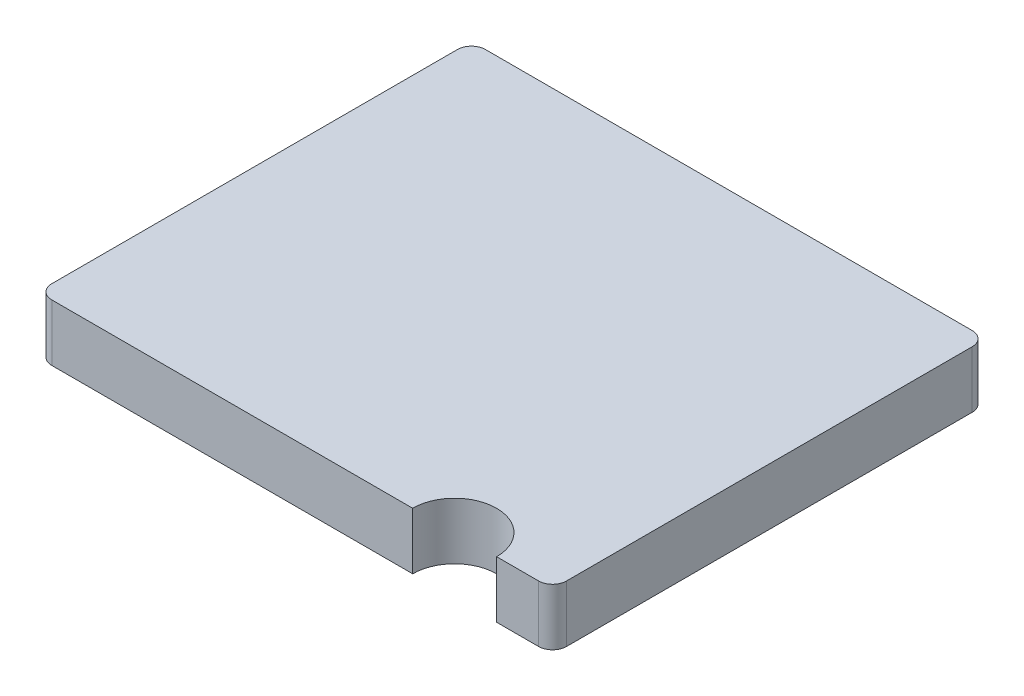
ISO-10303-21;
HEADER;
FILE_DESCRIPTION(('STEP AP214'),'2;1');
FILE_NAME('part.step','',(''),(''),'','','');
FILE_SCHEMA(('AUTOMOTIVE_DESIGN { 1 0 10303 214 1 1 1 1 }'));
ENDSEC;
DATA;
#1=APPLICATION_CONTEXT('core data for automotive mechanical design processes');
#2=APPLICATION_PROTOCOL_DEFINITION('international standard','automotive_design',2000,#1);
#3=PRODUCT_CONTEXT('',#1,'mechanical');
#4=PRODUCT('Part','Part','',(#3));
#5=PRODUCT_RELATED_PRODUCT_CATEGORY('part','',(#4));
#6=PRODUCT_DEFINITION_FORMATION('','',#4);
#7=PRODUCT_DEFINITION_CONTEXT('part definition',#1,'design');
#8=PRODUCT_DEFINITION('design','',#6,#7);
#9=PRODUCT_DEFINITION_SHAPE('','',#8);
#10=(LENGTH_UNIT() NAMED_UNIT(*) SI_UNIT(.MILLI.,.METRE.));
#11=(NAMED_UNIT(*) PLANE_ANGLE_UNIT() SI_UNIT($,.RADIAN.));
#12=(NAMED_UNIT(*) SI_UNIT($,.STERADIAN.) SOLID_ANGLE_UNIT());
#13=UNCERTAINTY_MEASURE_WITH_UNIT(LENGTH_MEASURE(1.E-05),#10,'distance_accuracy_value','');
#14=(GEOMETRIC_REPRESENTATION_CONTEXT(3) GLOBAL_UNCERTAINTY_ASSIGNED_CONTEXT((#13)) GLOBAL_UNIT_ASSIGNED_CONTEXT((#10,
#11,#12)) REPRESENTATION_CONTEXT('',''));
#15=CARTESIAN_POINT('',(0.,0.,0.));
#16=DIRECTION('',(0.,0.,1.));
#17=DIRECTION('',(1.,0.,0.));
#18=AXIS2_PLACEMENT_3D('',#15,#16,#17);
#19=CARTESIAN_POINT('',(-0.919999999999999,0.203,0.775));
#20=DIRECTION('',(0.,0.,-1.));
#21=DIRECTION('',(-1.,0.,0.));
#22=AXIS2_PLACEMENT_3D('',#19,#20,#21);
#23=PLANE('',#22);
#24=DIRECTION('',(1.,0.,0.));
#25=VECTOR('',#24,1.);
#26=CARTESIAN_POINT('',(-0.919999999999999,0.,0.775));
#27=LINE('',#26,#25);
#28=CARTESIAN_POINT('',(-0.869999999999999,0.,0.775));
#29=VERTEX_POINT('',#28);
#30=CARTESIAN_POINT('',(0.420000000000001,0.,0.775));
#31=VERTEX_POINT('',#30);
#32=EDGE_CURVE('E129',#29,#31,#27,.T.);
#33=ORIENTED_EDGE('',*,*,#32,.T.);
#34=DIRECTION('',(0.,1.,0.));
#35=VECTOR('',#34,1.);
#36=CARTESIAN_POINT('',(0.420000000000001,0.,0.775));
#37=LINE('',#36,#35);
#38=CARTESIAN_POINT('',(0.420000000000001,0.203,0.775));
#39=VERTEX_POINT('',#38);
#40=EDGE_CURVE('E51',#31,#39,#37,.T.);
#41=ORIENTED_EDGE('',*,*,#40,.T.);
#42=DIRECTION('',(1.,0.,0.));
#43=VECTOR('',#42,1.);
#44=CARTESIAN_POINT('',(-0.919999999999999,0.203,0.775));
#45=LINE('',#44,#43);
#46=CARTESIAN_POINT('',(-0.869999999999999,0.203,0.775));
#47=VERTEX_POINT('',#46);
#48=EDGE_CURVE('E141',#47,#39,#45,.T.);
#49=ORIENTED_EDGE('',*,*,#48,.F.);
#50=DIRECTION('',(0.,-1.,0.));
#51=VECTOR('',#50,1.);
#52=CARTESIAN_POINT('',(-0.869999999999999,0.203,0.775));
#53=LINE('',#52,#51);
#54=EDGE_CURVE('E44',#47,#29,#53,.T.);
#55=ORIENTED_EDGE('',*,*,#54,.T.);
#56=EDGE_LOOP('',(#33,#41,#49,#55));
#57=FACE_BOUND('',#56,.T.);
#58=ADVANCED_FACE('F36',(#57),#23,.F.);
#59=CARTESIAN_POINT('',(0.92,0.203,-0.775));
#60=DIRECTION('',(-1.,0.,0.));
#61=DIRECTION('',(0.,0.,1.));
#62=AXIS2_PLACEMENT_3D('',#59,#60,#61);
#63=PLANE('',#62);
#64=DIRECTION('',(0.,0.,-1.));
#65=VECTOR('',#64,1.);
#66=CARTESIAN_POINT('',(0.92,0.,-0.775));
#67=LINE('',#66,#65);
#68=CARTESIAN_POINT('',(0.920000000000001,0.,0.725));
#69=VERTEX_POINT('',#68);
#70=CARTESIAN_POINT('',(0.92,0.,-0.725));
#71=VERTEX_POINT('',#70);
#72=EDGE_CURVE('E192',#69,#71,#67,.T.);
#73=ORIENTED_EDGE('',*,*,#72,.T.);
#74=DIRECTION('',(0.,-1.,0.));
#75=VECTOR('',#74,1.);
#76=CARTESIAN_POINT('',(0.92,0.203,-0.725));
#77=LINE('',#76,#75);
#78=CARTESIAN_POINT('',(0.92,0.203,-0.725));
#79=VERTEX_POINT('',#78);
#80=EDGE_CURVE('E167',#71,#79,#77,.F.);
#81=ORIENTED_EDGE('',*,*,#80,.T.);
#82=DIRECTION('',(0.,0.,-1.));
#83=VECTOR('',#82,1.);
#84=CARTESIAN_POINT('',(0.92,0.203,-0.775));
#85=LINE('',#84,#83);
#86=CARTESIAN_POINT('',(0.920000000000001,0.203,0.725));
#87=VERTEX_POINT('',#86);
#88=EDGE_CURVE('E132',#87,#79,#85,.T.);
#89=ORIENTED_EDGE('',*,*,#88,.F.);
#90=DIRECTION('',(0.,-1.,0.));
#91=VECTOR('',#90,1.);
#92=CARTESIAN_POINT('',(0.920000000000001,0.203,0.725));
#93=LINE('',#92,#91);
#94=EDGE_CURVE('E164',#87,#69,#93,.T.);
#95=ORIENTED_EDGE('',*,*,#94,.T.);
#96=EDGE_LOOP('',(#73,#81,#89,#95));
#97=FACE_BOUND('',#96,.T.);
#98=ADVANCED_FACE('F216',(#97),#63,.F.);
#99=CARTESIAN_POINT('',(-0.92,0.203,-0.775));
#100=DIRECTION('',(0.,0.,1.));
#101=DIRECTION('',(1.,0.,0.));
#102=AXIS2_PLACEMENT_3D('',#99,#100,#101);
#103=PLANE('',#102);
#104=DIRECTION('',(-1.,0.,0.));
#105=VECTOR('',#104,1.);
#106=CARTESIAN_POINT('',(-0.92,0.,-0.775));
#107=LINE('',#106,#105);
#108=CARTESIAN_POINT('',(0.87,0.,-0.775));
#109=VERTEX_POINT('',#108);
#110=CARTESIAN_POINT('',(-0.87,0.,-0.775));
#111=VERTEX_POINT('',#110);
#112=EDGE_CURVE('E134',#109,#111,#107,.T.);
#113=ORIENTED_EDGE('',*,*,#112,.T.);
#114=DIRECTION('',(0.,-1.,0.));
#115=VECTOR('',#114,1.);
#116=CARTESIAN_POINT('',(-0.87,0.203,-0.775));
#117=LINE('',#116,#115);
#118=CARTESIAN_POINT('',(-0.87,0.203,-0.775));
#119=VERTEX_POINT('',#118);
#120=EDGE_CURVE('E154',#111,#119,#117,.F.);
#121=ORIENTED_EDGE('',*,*,#120,.T.);
#122=DIRECTION('',(-1.,0.,0.));
#123=VECTOR('',#122,1.);
#124=CARTESIAN_POINT('',(-0.92,0.203,-0.775));
#125=LINE('',#124,#123);
#126=CARTESIAN_POINT('',(0.87,0.203,-0.775));
#127=VERTEX_POINT('',#126);
#128=EDGE_CURVE('E186',#127,#119,#125,.T.);
#129=ORIENTED_EDGE('',*,*,#128,.F.);
#130=DIRECTION('',(0.,-1.,0.));
#131=VECTOR('',#130,1.);
#132=CARTESIAN_POINT('',(0.87,0.203,-0.775));
#133=LINE('',#132,#131);
#134=EDGE_CURVE('E151',#127,#109,#133,.T.);
#135=ORIENTED_EDGE('',*,*,#134,.T.);
#136=EDGE_LOOP('',(#113,#121,#129,#135));
#137=FACE_BOUND('',#136,.T.);
#138=ADVANCED_FACE('F198',(#137),#103,.F.);
#139=CARTESIAN_POINT('',(-0.92,0.203,-0.775));
#140=DIRECTION('',(1.,0.,0.));
#141=DIRECTION('',(0.,0.,-1.));
#142=AXIS2_PLACEMENT_3D('',#139,#140,#141);
#143=PLANE('',#142);
#144=DIRECTION('',(0.,0.,1.));
#145=VECTOR('',#144,1.);
#146=CARTESIAN_POINT('',(-0.92,0.203,-0.775));
#147=LINE('',#146,#145);
#148=CARTESIAN_POINT('',(-0.92,0.203,-0.725));
#149=VERTEX_POINT('',#148);
#150=CARTESIAN_POINT('',(-0.919999999999999,0.203,0.725));
#151=VERTEX_POINT('',#150);
#152=EDGE_CURVE('E183',#149,#151,#147,.T.);
#153=ORIENTED_EDGE('',*,*,#152,.F.);
#154=DIRECTION('',(0.,-1.,0.));
#155=VECTOR('',#154,1.);
#156=CARTESIAN_POINT('',(-0.92,0.203,-0.725));
#157=LINE('',#156,#155);
#158=CARTESIAN_POINT('',(-0.92,0.,-0.725));
#159=VERTEX_POINT('',#158);
#160=EDGE_CURVE('E140',#149,#159,#157,.T.);
#161=ORIENTED_EDGE('',*,*,#160,.T.);
#162=DIRECTION('',(0.,0.,1.));
#163=VECTOR('',#162,1.);
#164=CARTESIAN_POINT('',(-0.92,0.,-0.775));
#165=LINE('',#164,#163);
#166=CARTESIAN_POINT('',(-0.919999999999999,0.,0.725));
#167=VERTEX_POINT('',#166);
#168=EDGE_CURVE('E130',#159,#167,#165,.T.);
#169=ORIENTED_EDGE('',*,*,#168,.T.);
#170=DIRECTION('',(0.,-1.,0.));
#171=VECTOR('',#170,1.);
#172=CARTESIAN_POINT('',(-0.919999999999999,0.203,0.725));
#173=LINE('',#172,#171);
#174=EDGE_CURVE('E138',#167,#151,#173,.F.);
#175=ORIENTED_EDGE('',*,*,#174,.T.);
#176=EDGE_LOOP('',(#153,#161,#169,#175));
#177=FACE_BOUND('',#176,.T.);
#178=ADVANCED_FACE('F179',(#177),#143,.F.);
#179=CARTESIAN_POINT('',(0.720000000000001,0.203,0.775));
#180=VERTEX_POINT('',#179);
#181=CARTESIAN_POINT('',(0.87,0.203,0.775));
#182=VERTEX_POINT('',#181);
#183=EDGE_CURVE('E59',#180,#182,#45,.T.);
#184=ORIENTED_EDGE('',*,*,#183,.F.);
#185=DIRECTION('',(0.,1.,0.));
#186=VECTOR('',#185,1.);
#187=CARTESIAN_POINT('',(0.720000000000001,0.,0.775));
#188=LINE('',#187,#186);
#189=CARTESIAN_POINT('',(0.720000000000001,0.,0.775));
#190=VERTEX_POINT('',#189);
#191=EDGE_CURVE('E113',#180,#190,#188,.F.);
#192=ORIENTED_EDGE('',*,*,#191,.T.);
#193=CARTESIAN_POINT('',(0.87,0.,0.775));
#194=VERTEX_POINT('',#193);
#195=EDGE_CURVE('E122',#190,#194,#27,.T.);
#196=ORIENTED_EDGE('',*,*,#195,.T.);
#197=DIRECTION('',(0.,-1.,0.));
#198=VECTOR('',#197,1.);
#199=CARTESIAN_POINT('',(0.87,0.203,0.775));
#200=LINE('',#199,#198);
#201=EDGE_CURVE('E11',#194,#182,#200,.F.);
#202=ORIENTED_EDGE('',*,*,#201,.T.);
#203=EDGE_LOOP('',(#184,#192,#196,#202));
#204=FACE_BOUND('',#203,.T.);
#205=ADVANCED_FACE('F121',(#204),#23,.F.);
#206=CARTESIAN_POINT('',(0.,0.203,0.));
#207=DIRECTION('',(0.,1.,0.));
#208=DIRECTION('',(0.,0.,1.));
#209=AXIS2_PLACEMENT_3D('',#206,#207,#208);
#210=PLANE('',#209);
#211=CARTESIAN_POINT('',(0.570000000000001,0.203,0.775));
#212=DIRECTION('',(0.,1.,0.));
#213=DIRECTION('',(0.,0.,1.));
#214=AXIS2_PLACEMENT_3D('',#211,#212,#213);
#215=CIRCLE('',#214,0.15);
#216=EDGE_CURVE('E118',#180,#39,#215,.T.);
#217=ORIENTED_EDGE('',*,*,#216,.F.);
#218=ORIENTED_EDGE('',*,*,#183,.T.);
#219=CARTESIAN_POINT('',(0.870000000000001,0.203,0.725));
#220=DIRECTION('',(0.,1.,0.));
#221=DIRECTION('',(0.,0.,1.));
#222=AXIS2_PLACEMENT_3D('',#219,#220,#221);
#223=CIRCLE('',#222,0.05);
#224=EDGE_CURVE('E158',#182,#87,#223,.T.);
#225=ORIENTED_EDGE('',*,*,#224,.T.);
#226=ORIENTED_EDGE('',*,*,#88,.T.);
#227=CARTESIAN_POINT('',(0.87,0.203,-0.725));
#228=DIRECTION('',(0.,1.,0.));
#229=DIRECTION('',(0.,0.,1.));
#230=AXIS2_PLACEMENT_3D('',#227,#228,#229);
#231=CIRCLE('',#230,0.05);
#232=EDGE_CURVE('E160',#79,#127,#231,.T.);
#233=ORIENTED_EDGE('',*,*,#232,.T.);
#234=ORIENTED_EDGE('',*,*,#128,.T.);
#235=CARTESIAN_POINT('',(-0.87,0.203,-0.725));
#236=DIRECTION('',(0.,1.,0.));
#237=DIRECTION('',(0.,0.,1.));
#238=AXIS2_PLACEMENT_3D('',#235,#236,#237);
#239=CIRCLE('',#238,0.05);
#240=EDGE_CURVE('E162',#119,#149,#239,.T.);
#241=ORIENTED_EDGE('',*,*,#240,.T.);
#242=ORIENTED_EDGE('',*,*,#152,.T.);
#243=CARTESIAN_POINT('',(-0.869999999999999,0.203,0.725));
#244=DIRECTION('',(0.,1.,0.));
#245=DIRECTION('',(0.,0.,1.));
#246=AXIS2_PLACEMENT_3D('',#243,#244,#245);
#247=CIRCLE('',#246,0.05);
#248=EDGE_CURVE('E156',#151,#47,#247,.T.);
#249=ORIENTED_EDGE('',*,*,#248,.T.);
#250=ORIENTED_EDGE('',*,*,#48,.T.);
#251=EDGE_LOOP('',(#217,#218,#225,#226,#233,#234,#241,#242,#249,#250));
#252=FACE_BOUND('',#251,.T.);
#253=ADVANCED_FACE('F182',(#252),#210,.T.);
#254=CARTESIAN_POINT('',(0.,0.,0.));
#255=DIRECTION('',(0.,1.,0.));
#256=DIRECTION('',(0.,0.,1.));
#257=AXIS2_PLACEMENT_3D('',#254,#255,#256);
#258=PLANE('',#257);
#259=ORIENTED_EDGE('',*,*,#195,.F.);
#260=CARTESIAN_POINT('',(0.570000000000001,0.,0.775));
#261=DIRECTION('',(0.,1.,0.));
#262=DIRECTION('',(0.,0.,1.));
#263=AXIS2_PLACEMENT_3D('',#260,#261,#262);
#264=CIRCLE('',#263,0.15);
#265=EDGE_CURVE('E110',#190,#31,#264,.T.);
#266=ORIENTED_EDGE('',*,*,#265,.T.);
#267=ORIENTED_EDGE('',*,*,#32,.F.);
#268=CARTESIAN_POINT('',(-0.869999999999999,0.,0.725));
#269=DIRECTION('',(0.,1.,0.));
#270=DIRECTION('',(0.,0.,1.));
#271=AXIS2_PLACEMENT_3D('',#268,#269,#270);
#272=CIRCLE('',#271,0.05);
#273=EDGE_CURVE('E144',#29,#167,#272,.F.);
#274=ORIENTED_EDGE('',*,*,#273,.T.);
#275=ORIENTED_EDGE('',*,*,#168,.F.);
#276=CARTESIAN_POINT('',(-0.87,0.,-0.725));
#277=DIRECTION('',(0.,1.,0.));
#278=DIRECTION('',(0.,0.,1.));
#279=AXIS2_PLACEMENT_3D('',#276,#277,#278);
#280=CIRCLE('',#279,0.05);
#281=EDGE_CURVE('E149',#159,#111,#280,.F.);
#282=ORIENTED_EDGE('',*,*,#281,.T.);
#283=ORIENTED_EDGE('',*,*,#112,.F.);
#284=CARTESIAN_POINT('',(0.87,0.,-0.725));
#285=DIRECTION('',(0.,1.,0.));
#286=DIRECTION('',(0.,0.,1.));
#287=AXIS2_PLACEMENT_3D('',#284,#285,#286);
#288=CIRCLE('',#287,0.05);
#289=EDGE_CURVE('E147',#109,#71,#288,.F.);
#290=ORIENTED_EDGE('',*,*,#289,.T.);
#291=ORIENTED_EDGE('',*,*,#72,.F.);
#292=CARTESIAN_POINT('',(0.870000000000001,0.,0.725));
#293=DIRECTION('',(0.,1.,0.));
#294=DIRECTION('',(0.,0.,1.));
#295=AXIS2_PLACEMENT_3D('',#292,#293,#294);
#296=CIRCLE('',#295,0.05);
#297=EDGE_CURVE('E127',#69,#194,#296,.F.);
#298=ORIENTED_EDGE('',*,*,#297,.T.);
#299=EDGE_LOOP('',(#259,#266,#267,#274,#275,#282,#283,#290,#291,#298));
#300=FACE_BOUND('',#299,.T.);
#301=ADVANCED_FACE('F125',(#300),#258,.F.);
#302=CARTESIAN_POINT('',(-0.87,0.203,-0.725));
#303=DIRECTION('',(0.,-1.,0.));
#304=DIRECTION('',(0.,0.,-1.));
#305=AXIS2_PLACEMENT_3D('',#302,#303,#304);
#306=CYLINDRICAL_SURFACE('',#305,0.05);
#307=ORIENTED_EDGE('',*,*,#240,.F.);
#308=ORIENTED_EDGE('',*,*,#120,.F.);
#309=ORIENTED_EDGE('',*,*,#281,.F.);
#310=ORIENTED_EDGE('',*,*,#160,.F.);
#311=EDGE_LOOP('',(#307,#308,#309,#310));
#312=FACE_BOUND('',#311,.T.);
#313=ADVANCED_FACE('F202',(#312),#306,.T.);
#314=CARTESIAN_POINT('',(0.87,0.203,-0.725));
#315=DIRECTION('',(0.,-1.,0.));
#316=DIRECTION('',(0.,0.,-1.));
#317=AXIS2_PLACEMENT_3D('',#314,#315,#316);
#318=CYLINDRICAL_SURFACE('',#317,0.05);
#319=ORIENTED_EDGE('',*,*,#232,.F.);
#320=ORIENTED_EDGE('',*,*,#80,.F.);
#321=ORIENTED_EDGE('',*,*,#289,.F.);
#322=ORIENTED_EDGE('',*,*,#134,.F.);
#323=EDGE_LOOP('',(#319,#320,#321,#322));
#324=FACE_BOUND('',#323,.T.);
#325=ADVANCED_FACE('F204',(#324),#318,.T.);
#326=CARTESIAN_POINT('',(0.870000000000001,0.203,0.725));
#327=DIRECTION('',(0.,-1.,0.));
#328=DIRECTION('',(0.,0.,-1.));
#329=AXIS2_PLACEMENT_3D('',#326,#327,#328);
#330=CYLINDRICAL_SURFACE('',#329,0.05);
#331=ORIENTED_EDGE('',*,*,#224,.F.);
#332=ORIENTED_EDGE('',*,*,#201,.F.);
#333=ORIENTED_EDGE('',*,*,#297,.F.);
#334=ORIENTED_EDGE('',*,*,#94,.F.);
#335=EDGE_LOOP('',(#331,#332,#333,#334));
#336=FACE_BOUND('',#335,.T.);
#337=ADVANCED_FACE('F210',(#336),#330,.T.);
#338=CARTESIAN_POINT('',(-0.869999999999999,0.203,0.725));
#339=DIRECTION('',(0.,-1.,0.));
#340=DIRECTION('',(0.,0.,-1.));
#341=AXIS2_PLACEMENT_3D('',#338,#339,#340);
#342=CYLINDRICAL_SURFACE('',#341,0.05);
#343=ORIENTED_EDGE('',*,*,#248,.F.);
#344=ORIENTED_EDGE('',*,*,#174,.F.);
#345=ORIENTED_EDGE('',*,*,#273,.F.);
#346=ORIENTED_EDGE('',*,*,#54,.F.);
#347=EDGE_LOOP('',(#343,#344,#345,#346));
#348=FACE_BOUND('',#347,.T.);
#349=ADVANCED_FACE('F38',(#348),#342,.T.);
#350=CARTESIAN_POINT('',(0.570000000000001,0.,0.775));
#351=DIRECTION('',(0.,1.,0.));
#352=DIRECTION('',(0.,0.,1.));
#353=AXIS2_PLACEMENT_3D('',#350,#351,#352);
#354=CYLINDRICAL_SURFACE('',#353,0.15);
#355=ORIENTED_EDGE('',*,*,#265,.F.);
#356=ORIENTED_EDGE('',*,*,#191,.F.);
#357=ORIENTED_EDGE('',*,*,#216,.T.);
#358=ORIENTED_EDGE('',*,*,#40,.F.);
#359=EDGE_LOOP('',(#355,#356,#357,#358));
#360=FACE_BOUND('',#359,.T.);
#361=ADVANCED_FACE('F112',(#360),#354,.F.);
#362=CLOSED_SHELL('',(#58,#98,#138,#178,#205,#253,#301,#313,#325,#337,#349,#361));
#363=MANIFOLD_SOLID_BREP('B2',#362);
#364=ADVANCED_BREP_SHAPE_REPRESENTATION('',(#18,#363),#14);
#365=SHAPE_DEFINITION_REPRESENTATION(#9,#364);
ENDSEC;
END-ISO-10303-21;
